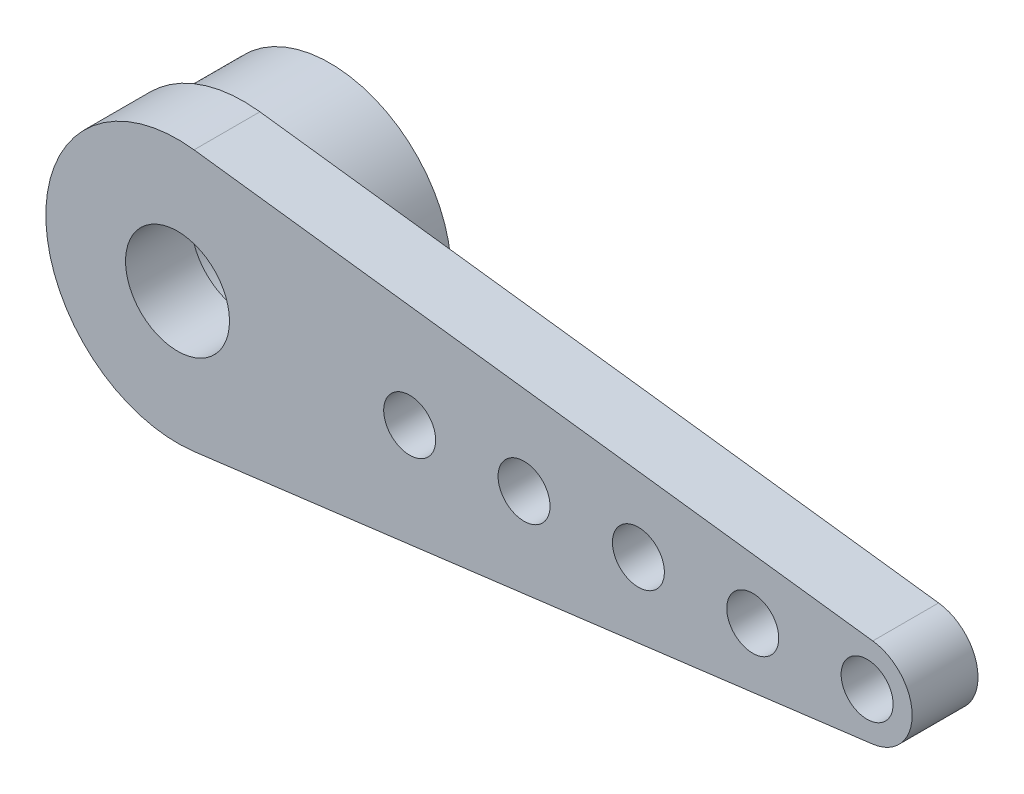
ISO-10303-21;
HEADER;
FILE_DESCRIPTION(('STEP AP214'),'2;1');
FILE_NAME('part.step','',(''),(''),'','','');
FILE_SCHEMA(('AUTOMOTIVE_DESIGN { 1 0 10303 214 1 1 1 1 }'));
ENDSEC;
DATA;
#1=APPLICATION_CONTEXT('core data for automotive mechanical design processes');
#2=APPLICATION_PROTOCOL_DEFINITION('international standard','automotive_design',2000,#1);
#3=PRODUCT_CONTEXT('',#1,'mechanical');
#4=PRODUCT('Part','Part','',(#3));
#5=PRODUCT_RELATED_PRODUCT_CATEGORY('part','',(#4));
#6=PRODUCT_DEFINITION_FORMATION('','',#4);
#7=PRODUCT_DEFINITION_CONTEXT('part definition',#1,'design');
#8=PRODUCT_DEFINITION('design','',#6,#7);
#9=PRODUCT_DEFINITION_SHAPE('','',#8);
#10=(LENGTH_UNIT() NAMED_UNIT(*) SI_UNIT(.MILLI.,.METRE.));
#11=(NAMED_UNIT(*) PLANE_ANGLE_UNIT() SI_UNIT($,.RADIAN.));
#12=(NAMED_UNIT(*) SI_UNIT($,.STERADIAN.) SOLID_ANGLE_UNIT());
#13=UNCERTAINTY_MEASURE_WITH_UNIT(LENGTH_MEASURE(1.E-05),#10,'distance_accuracy_value','');
#14=(GEOMETRIC_REPRESENTATION_CONTEXT(3) GLOBAL_UNCERTAINTY_ASSIGNED_CONTEXT((#13)) GLOBAL_UNIT_ASSIGNED_CONTEXT((#10,
#11,#12)) REPRESENTATION_CONTEXT('',''));
#15=CARTESIAN_POINT('',(0.,0.,0.));
#16=DIRECTION('',(0.,0.,1.));
#17=DIRECTION('',(1.,0.,0.));
#18=AXIS2_PLACEMENT_3D('',#15,#16,#17);
#19=CARTESIAN_POINT('',(0.,0.,0.));
#20=DIRECTION('',(0.,0.,1.));
#21=DIRECTION('',(1.,0.,0.));
#22=AXIS2_PLACEMENT_3D('',#19,#20,#21);
#23=PLANE('',#22);
#24=CARTESIAN_POINT('',(0.,0.,0.));
#25=DIRECTION('',(0.,0.,1.));
#26=DIRECTION('',(1.,0.,0.));
#27=AXIS2_PLACEMENT_3D('',#24,#25,#26);
#28=CIRCLE('',#27,1.5);
#29=CARTESIAN_POINT('',(1.5,0.,0.));
#30=VERTEX_POINT('',#29);
#31=EDGE_CURVE('E120',#30,#30,#28,.T.);
#32=ORIENTED_EDGE('',*,*,#31,.T.);
#33=EDGE_LOOP('',(#32));
#34=FACE_BOUND('',#33,.T.);
#35=CARTESIAN_POINT('',(0.,0.,0.));
#36=DIRECTION('',(0.,0.,1.));
#37=DIRECTION('',(1.,0.,0.));
#38=AXIS2_PLACEMENT_3D('',#35,#36,#37);
#39=CIRCLE('',#38,2.30779537514356);
#40=CARTESIAN_POINT('',(2.30779537514356,0.,0.));
#41=VERTEX_POINT('',#40);
#42=EDGE_CURVE('E11',#41,#41,#39,.T.);
#43=ORIENTED_EDGE('',*,*,#42,.F.);
#44=EDGE_LOOP('',(#43));
#45=FACE_BOUND('',#44,.T.);
#46=ADVANCED_FACE('F37',(#34,#45),#23,.F.);
#47=CARTESIAN_POINT('',(0.,0.,1.9));
#48=DIRECTION('',(0.,0.,1.));
#49=DIRECTION('',(1.,0.,0.));
#50=AXIS2_PLACEMENT_3D('',#47,#48,#49);
#51=PLANE('',#50);
#52=CARTESIAN_POINT('',(13.3,0.,1.9));
#53=DIRECTION('',(0.,0.,1.));
#54=DIRECTION('',(1.,0.,0.));
#55=AXIS2_PLACEMENT_3D('',#52,#53,#54);
#56=CIRCLE('',#55,0.75);
#57=CARTESIAN_POINT('',(14.05,0.,1.9));
#58=VERTEX_POINT('',#57);
#59=EDGE_CURVE('E141',#58,#58,#56,.T.);
#60=ORIENTED_EDGE('',*,*,#59,.F.);
#61=EDGE_LOOP('',(#60));
#62=FACE_BOUND('',#61,.T.);
#63=CARTESIAN_POINT('',(6.7,0.,1.9));
#64=DIRECTION('',(0.,0.,1.));
#65=DIRECTION('',(1.,0.,0.));
#66=AXIS2_PLACEMENT_3D('',#63,#64,#65);
#67=CIRCLE('',#66,0.749999999999999);
#68=CARTESIAN_POINT('',(7.45,0.,1.9));
#69=VERTEX_POINT('',#68);
#70=EDGE_CURVE('E129',#69,#69,#67,.T.);
#71=ORIENTED_EDGE('',*,*,#70,.F.);
#72=EDGE_LOOP('',(#71));
#73=FACE_BOUND('',#72,.T.);
#74=CARTESIAN_POINT('',(0.,0.,1.9));
#75=DIRECTION('',(0.,0.,1.));
#76=DIRECTION('',(1.,0.,0.));
#77=AXIS2_PLACEMENT_3D('',#74,#75,#76);
#78=CIRCLE('',#77,1.5);
#79=CARTESIAN_POINT('',(1.5,0.,1.9));
#80=VERTEX_POINT('',#79);
#81=EDGE_CURVE('E108',#80,#80,#78,.T.);
#82=ORIENTED_EDGE('',*,*,#81,.F.);
#83=EDGE_LOOP('',(#82));
#84=FACE_BOUND('',#83,.T.);
#85=CARTESIAN_POINT('',(0.,0.,1.9));
#86=DIRECTION('',(0.,0.,1.));
#87=DIRECTION('',(1.,0.,0.));
#88=AXIS2_PLACEMENT_3D('',#85,#86,#87);
#89=CIRCLE('',#88,3.8);
#90=CARTESIAN_POINT('',(0.477386934673366,3.76989412511852,1.9));
#91=VERTEX_POINT('',#90);
#92=CARTESIAN_POINT('',(0.477386934673366,-3.76989412511852,1.9));
#93=VERTEX_POINT('',#92);
#94=EDGE_CURVE('E92',#91,#93,#89,.T.);
#95=ORIENTED_EDGE('',*,*,#94,.T.);
#96=DIRECTION('',(0.99207740134698,0.125628140703517,0.));
#97=VECTOR('',#96,1.);
#98=CARTESIAN_POINT('',(0.477386934673366,-3.76989412511852,1.9));
#99=LINE('',#98,#97);
#100=CARTESIAN_POINT('',(20.0633165829146,-1.28970062175108,1.9));
#101=VERTEX_POINT('',#100);
#102=EDGE_CURVE('E86',#93,#101,#99,.T.);
#103=ORIENTED_EDGE('',*,*,#102,.T.);
#104=CARTESIAN_POINT('',(19.9,0.,1.9));
#105=DIRECTION('',(0.,0.,1.));
#106=DIRECTION('',(1.,0.,0.));
#107=AXIS2_PLACEMENT_3D('',#104,#105,#106);
#108=CIRCLE('',#107,1.3);
#109=CARTESIAN_POINT('',(20.0633165829146,1.28970062175108,1.9));
#110=VERTEX_POINT('',#109);
#111=EDGE_CURVE('E90',#101,#110,#108,.T.);
#112=ORIENTED_EDGE('',*,*,#111,.T.);
#113=DIRECTION('',(-0.99207740134698,0.125628140703517,0.));
#114=VECTOR('',#113,1.);
#115=CARTESIAN_POINT('',(0.477386934673366,3.76989412511852,1.9));
#116=LINE('',#115,#114);
#117=EDGE_CURVE('E55',#110,#91,#116,.T.);
#118=ORIENTED_EDGE('',*,*,#117,.T.);
#119=EDGE_LOOP('',(#95,#103,#112,#118));
#120=FACE_BOUND('',#119,.T.);
#121=CARTESIAN_POINT('',(19.9,0.,1.9));
#122=DIRECTION('',(0.,0.,1.));
#123=DIRECTION('',(1.,0.,0.));
#124=AXIS2_PLACEMENT_3D('',#121,#122,#123);
#125=CIRCLE('',#124,0.750000000000002);
#126=CARTESIAN_POINT('',(20.65,0.,1.9));
#127=VERTEX_POINT('',#126);
#128=EDGE_CURVE('E123',#127,#127,#125,.T.);
#129=ORIENTED_EDGE('',*,*,#128,.F.);
#130=EDGE_LOOP('',(#129));
#131=FACE_BOUND('',#130,.T.);
#132=CARTESIAN_POINT('',(10.,0.,1.9));
#133=DIRECTION('',(0.,0.,1.));
#134=DIRECTION('',(1.,0.,0.));
#135=AXIS2_PLACEMENT_3D('',#132,#133,#134);
#136=CIRCLE('',#135,0.75);
#137=CARTESIAN_POINT('',(10.75,0.,1.9));
#138=VERTEX_POINT('',#137);
#139=EDGE_CURVE('E135',#138,#138,#136,.T.);
#140=ORIENTED_EDGE('',*,*,#139,.F.);
#141=EDGE_LOOP('',(#140));
#142=FACE_BOUND('',#141,.T.);
#143=CARTESIAN_POINT('',(16.6,0.,1.9));
#144=DIRECTION('',(0.,0.,1.));
#145=DIRECTION('',(1.,0.,0.));
#146=AXIS2_PLACEMENT_3D('',#143,#144,#145);
#147=CIRCLE('',#146,0.750000000000002);
#148=CARTESIAN_POINT('',(17.35,0.,1.9));
#149=VERTEX_POINT('',#148);
#150=EDGE_CURVE('E147',#149,#149,#147,.T.);
#151=ORIENTED_EDGE('',*,*,#150,.F.);
#152=EDGE_LOOP('',(#151));
#153=FACE_BOUND('',#152,.T.);
#154=ADVANCED_FACE('F87',(#62,#73,#84,#120,#131,#142,#153),#51,.T.);
#155=CARTESIAN_POINT('',(0.,0.,0.));
#156=DIRECTION('',(0.,0.,1.));
#157=DIRECTION('',(1.,0.,0.));
#158=AXIS2_PLACEMENT_3D('',#155,#156,#157);
#159=CIRCLE('',#158,3.5);
#160=CARTESIAN_POINT('',(3.5,0.,0.));
#161=VERTEX_POINT('',#160);
#162=EDGE_CURVE('E156',#161,#161,#159,.T.);
#163=ORIENTED_EDGE('',*,*,#162,.T.);
#164=EDGE_LOOP('',(#163));
#165=FACE_BOUND('',#164,.T.);
#166=CARTESIAN_POINT('',(0.,0.,0.));
#167=DIRECTION('',(0.,0.,1.));
#168=DIRECTION('',(1.,0.,0.));
#169=AXIS2_PLACEMENT_3D('',#166,#167,#168);
#170=CIRCLE('',#169,3.8);
#171=CARTESIAN_POINT('',(0.477386934673366,3.76989412511852,0.));
#172=VERTEX_POINT('',#171);
#173=CARTESIAN_POINT('',(0.477386934673366,-3.76989412511852,0.));
#174=VERTEX_POINT('',#173);
#175=EDGE_CURVE('E105',#172,#174,#170,.T.);
#176=ORIENTED_EDGE('',*,*,#175,.F.);
#177=DIRECTION('',(-0.99207740134698,0.125628140703517,0.));
#178=VECTOR('',#177,1.);
#179=CARTESIAN_POINT('',(0.477386934673366,3.76989412511852,0.));
#180=LINE('',#179,#178);
#181=CARTESIAN_POINT('',(20.0633165829146,1.28970062175108,0.));
#182=VERTEX_POINT('',#181);
#183=EDGE_CURVE('E78',#182,#172,#180,.T.);
#184=ORIENTED_EDGE('',*,*,#183,.F.);
#185=CARTESIAN_POINT('',(19.9,0.,0.));
#186=DIRECTION('',(0.,0.,1.));
#187=DIRECTION('',(1.,0.,0.));
#188=AXIS2_PLACEMENT_3D('',#185,#186,#187);
#189=CIRCLE('',#188,1.3);
#190=CARTESIAN_POINT('',(20.0633165829146,-1.28970062175108,0.));
#191=VERTEX_POINT('',#190);
#192=EDGE_CURVE('E72',#191,#182,#189,.T.);
#193=ORIENTED_EDGE('',*,*,#192,.F.);
#194=DIRECTION('',(0.99207740134698,0.125628140703517,0.));
#195=VECTOR('',#194,1.);
#196=CARTESIAN_POINT('',(0.477386934673366,-3.76989412511852,0.));
#197=LINE('',#196,#195);
#198=EDGE_CURVE('E97',#174,#191,#197,.T.);
#199=ORIENTED_EDGE('',*,*,#198,.F.);
#200=EDGE_LOOP('',(#176,#184,#193,#199));
#201=FACE_BOUND('',#200,.T.);
#202=CARTESIAN_POINT('',(19.9,0.,0.));
#203=DIRECTION('',(0.,0.,1.));
#204=DIRECTION('',(1.,0.,0.));
#205=AXIS2_PLACEMENT_3D('',#202,#203,#204);
#206=CIRCLE('',#205,0.750000000000002);
#207=CARTESIAN_POINT('',(20.65,0.,0.));
#208=VERTEX_POINT('',#207);
#209=EDGE_CURVE('E126',#208,#208,#206,.T.);
#210=ORIENTED_EDGE('',*,*,#209,.T.);
#211=EDGE_LOOP('',(#210));
#212=FACE_BOUND('',#211,.T.);
#213=CARTESIAN_POINT('',(6.7,0.,0.));
#214=DIRECTION('',(0.,0.,1.));
#215=DIRECTION('',(1.,0.,0.));
#216=AXIS2_PLACEMENT_3D('',#213,#214,#215);
#217=CIRCLE('',#216,0.749999999999999);
#218=CARTESIAN_POINT('',(7.45,0.,0.));
#219=VERTEX_POINT('',#218);
#220=EDGE_CURVE('E132',#219,#219,#217,.T.);
#221=ORIENTED_EDGE('',*,*,#220,.T.);
#222=EDGE_LOOP('',(#221));
#223=FACE_BOUND('',#222,.T.);
#224=CARTESIAN_POINT('',(10.,0.,0.));
#225=DIRECTION('',(0.,0.,1.));
#226=DIRECTION('',(1.,0.,0.));
#227=AXIS2_PLACEMENT_3D('',#224,#225,#226);
#228=CIRCLE('',#227,0.75);
#229=CARTESIAN_POINT('',(10.75,0.,0.));
#230=VERTEX_POINT('',#229);
#231=EDGE_CURVE('E138',#230,#230,#228,.T.);
#232=ORIENTED_EDGE('',*,*,#231,.T.);
#233=EDGE_LOOP('',(#232));
#234=FACE_BOUND('',#233,.T.);
#235=CARTESIAN_POINT('',(13.3,0.,0.));
#236=DIRECTION('',(0.,0.,1.));
#237=DIRECTION('',(1.,0.,0.));
#238=AXIS2_PLACEMENT_3D('',#235,#236,#237);
#239=CIRCLE('',#238,0.75);
#240=CARTESIAN_POINT('',(14.05,0.,0.));
#241=VERTEX_POINT('',#240);
#242=EDGE_CURVE('E144',#241,#241,#239,.T.);
#243=ORIENTED_EDGE('',*,*,#242,.T.);
#244=EDGE_LOOP('',(#243));
#245=FACE_BOUND('',#244,.T.);
#246=CARTESIAN_POINT('',(16.6,0.,0.));
#247=DIRECTION('',(0.,0.,1.));
#248=DIRECTION('',(1.,0.,0.));
#249=AXIS2_PLACEMENT_3D('',#246,#247,#248);
#250=CIRCLE('',#249,0.750000000000002);
#251=CARTESIAN_POINT('',(17.35,0.,0.));
#252=VERTEX_POINT('',#251);
#253=EDGE_CURVE('E150',#252,#252,#250,.T.);
#254=ORIENTED_EDGE('',*,*,#253,.T.);
#255=EDGE_LOOP('',(#254));
#256=FACE_BOUND('',#255,.T.);
#257=ADVANCED_FACE('F116',(#165,#201,#212,#223,#234,#245,#256),#23,.F.);
#258=CARTESIAN_POINT('',(0.,0.,1.9));
#259=DIRECTION('',(0.,0.,-1.));
#260=DIRECTION('',(-1.,0.,0.));
#261=AXIS2_PLACEMENT_3D('',#258,#259,#260);
#262=CYLINDRICAL_SURFACE('',#261,3.8);
#263=ORIENTED_EDGE('',*,*,#175,.T.);
#264=DIRECTION('',(0.,0.,-1.));
#265=VECTOR('',#264,1.);
#266=CARTESIAN_POINT('',(0.477386934673366,-3.76989412511852,1.9));
#267=LINE('',#266,#265);
#268=EDGE_CURVE('E41',#93,#174,#267,.T.);
#269=ORIENTED_EDGE('',*,*,#268,.F.);
#270=ORIENTED_EDGE('',*,*,#94,.F.);
#271=DIRECTION('',(0.,0.,-1.));
#272=VECTOR('',#271,1.);
#273=CARTESIAN_POINT('',(0.477386934673366,3.76989412511852,1.9));
#274=LINE('',#273,#272);
#275=EDGE_CURVE('E101',#91,#172,#274,.T.);
#276=ORIENTED_EDGE('',*,*,#275,.T.);
#277=EDGE_LOOP('',(#263,#269,#270,#276));
#278=FACE_BOUND('',#277,.T.);
#279=ADVANCED_FACE('F39',(#278),#262,.T.);
#280=CARTESIAN_POINT('',(0.477386934673366,-3.76989412511852,1.9));
#281=DIRECTION('',(-0.125628140703517,0.99207740134698,0.));
#282=DIRECTION('',(-0.99207740134698,-0.125628140703517,0.));
#283=AXIS2_PLACEMENT_3D('',#280,#281,#282);
#284=PLANE('',#283);
#285=ORIENTED_EDGE('',*,*,#198,.T.);
#286=DIRECTION('',(0.,0.,-1.));
#287=VECTOR('',#286,1.);
#288=CARTESIAN_POINT('',(20.0633165829146,-1.28970062175108,1.9));
#289=LINE('',#288,#287);
#290=EDGE_CURVE('E95',#101,#191,#289,.T.);
#291=ORIENTED_EDGE('',*,*,#290,.F.);
#292=ORIENTED_EDGE('',*,*,#102,.F.);
#293=ORIENTED_EDGE('',*,*,#268,.T.);
#294=EDGE_LOOP('',(#285,#291,#292,#293));
#295=FACE_BOUND('',#294,.T.);
#296=ADVANCED_FACE('F96',(#295),#284,.F.);
#297=CARTESIAN_POINT('',(19.9,0.,1.9));
#298=DIRECTION('',(0.,0.,-1.));
#299=DIRECTION('',(-1.,0.,0.));
#300=AXIS2_PLACEMENT_3D('',#297,#298,#299);
#301=CYLINDRICAL_SURFACE('',#300,1.3);
#302=ORIENTED_EDGE('',*,*,#192,.T.);
#303=DIRECTION('',(0.,0.,-1.));
#304=VECTOR('',#303,1.);
#305=CARTESIAN_POINT('',(20.0633165829146,1.28970062175108,1.9));
#306=LINE('',#305,#304);
#307=EDGE_CURVE('E98',#110,#182,#306,.T.);
#308=ORIENTED_EDGE('',*,*,#307,.F.);
#309=ORIENTED_EDGE('',*,*,#111,.F.);
#310=ORIENTED_EDGE('',*,*,#290,.T.);
#311=EDGE_LOOP('',(#302,#308,#309,#310));
#312=FACE_BOUND('',#311,.T.);
#313=ADVANCED_FACE('F99',(#312),#301,.T.);
#314=CARTESIAN_POINT('',(0.477386934673366,3.76989412511852,1.9));
#315=DIRECTION('',(-0.125628140703517,-0.99207740134698,0.));
#316=DIRECTION('',(0.99207740134698,-0.125628140703517,0.));
#317=AXIS2_PLACEMENT_3D('',#314,#315,#316);
#318=PLANE('',#317);
#319=ORIENTED_EDGE('',*,*,#183,.T.);
#320=ORIENTED_EDGE('',*,*,#275,.F.);
#321=ORIENTED_EDGE('',*,*,#117,.F.);
#322=ORIENTED_EDGE('',*,*,#307,.T.);
#323=EDGE_LOOP('',(#319,#320,#321,#322));
#324=FACE_BOUND('',#323,.T.);
#325=ADVANCED_FACE('F113',(#324),#318,.F.);
#326=CARTESIAN_POINT('',(0.,0.,1.9));
#327=DIRECTION('',(0.,0.,-1.));
#328=DIRECTION('',(-1.,0.,0.));
#329=AXIS2_PLACEMENT_3D('',#326,#327,#328);
#330=CYLINDRICAL_SURFACE('',#329,1.5);
#331=ORIENTED_EDGE('',*,*,#81,.T.);
#332=EDGE_LOOP('',(#331));
#333=FACE_BOUND('',#332,.T.);
#334=ORIENTED_EDGE('',*,*,#31,.F.);
#335=EDGE_LOOP('',(#334));
#336=FACE_BOUND('',#335,.T.);
#337=ADVANCED_FACE('F218',(#333,#336),#330,.F.);
#338=CARTESIAN_POINT('',(19.9,0.,1.9));
#339=DIRECTION('',(0.,0.,-1.));
#340=DIRECTION('',(-1.,0.,0.));
#341=AXIS2_PLACEMENT_3D('',#338,#339,#340);
#342=CYLINDRICAL_SURFACE('',#341,0.750000000000002);
#343=ORIENTED_EDGE('',*,*,#128,.T.);
#344=EDGE_LOOP('',(#343));
#345=FACE_BOUND('',#344,.T.);
#346=ORIENTED_EDGE('',*,*,#209,.F.);
#347=EDGE_LOOP('',(#346));
#348=FACE_BOUND('',#347,.T.);
#349=ADVANCED_FACE('F214',(#345,#348),#342,.F.);
#350=CARTESIAN_POINT('',(6.7,0.,1.9));
#351=DIRECTION('',(0.,0.,-1.));
#352=DIRECTION('',(-1.,0.,0.));
#353=AXIS2_PLACEMENT_3D('',#350,#351,#352);
#354=CYLINDRICAL_SURFACE('',#353,0.749999999999999);
#355=ORIENTED_EDGE('',*,*,#70,.T.);
#356=EDGE_LOOP('',(#355));
#357=FACE_BOUND('',#356,.T.);
#358=ORIENTED_EDGE('',*,*,#220,.F.);
#359=EDGE_LOOP('',(#358));
#360=FACE_BOUND('',#359,.T.);
#361=ADVANCED_FACE('F210',(#357,#360),#354,.F.);
#362=CARTESIAN_POINT('',(10.,0.,1.9));
#363=DIRECTION('',(0.,0.,-1.));
#364=DIRECTION('',(-1.,0.,0.));
#365=AXIS2_PLACEMENT_3D('',#362,#363,#364);
#366=CYLINDRICAL_SURFACE('',#365,0.75);
#367=ORIENTED_EDGE('',*,*,#139,.T.);
#368=EDGE_LOOP('',(#367));
#369=FACE_BOUND('',#368,.T.);
#370=ORIENTED_EDGE('',*,*,#231,.F.);
#371=EDGE_LOOP('',(#370));
#372=FACE_BOUND('',#371,.T.);
#373=ADVANCED_FACE('F206',(#369,#372),#366,.F.);
#374=CARTESIAN_POINT('',(13.3,0.,1.9));
#375=DIRECTION('',(0.,0.,-1.));
#376=DIRECTION('',(-1.,0.,0.));
#377=AXIS2_PLACEMENT_3D('',#374,#375,#376);
#378=CYLINDRICAL_SURFACE('',#377,0.75);
#379=ORIENTED_EDGE('',*,*,#59,.T.);
#380=EDGE_LOOP('',(#379));
#381=FACE_BOUND('',#380,.T.);
#382=ORIENTED_EDGE('',*,*,#242,.F.);
#383=EDGE_LOOP('',(#382));
#384=FACE_BOUND('',#383,.T.);
#385=ADVANCED_FACE('F200',(#381,#384),#378,.F.);
#386=CARTESIAN_POINT('',(16.6,0.,1.9));
#387=DIRECTION('',(0.,0.,-1.));
#388=DIRECTION('',(-1.,0.,0.));
#389=AXIS2_PLACEMENT_3D('',#386,#387,#388);
#390=CYLINDRICAL_SURFACE('',#389,0.750000000000002);
#391=ORIENTED_EDGE('',*,*,#150,.T.);
#392=EDGE_LOOP('',(#391));
#393=FACE_BOUND('',#392,.T.);
#394=ORIENTED_EDGE('',*,*,#253,.F.);
#395=EDGE_LOOP('',(#394));
#396=FACE_BOUND('',#395,.T.);
#397=ADVANCED_FACE('F192',(#393,#396),#390,.F.);
#398=CARTESIAN_POINT('',(0.,0.,-2.5));
#399=DIRECTION('',(0.,0.,1.));
#400=DIRECTION('',(1.,0.,0.));
#401=AXIS2_PLACEMENT_3D('',#398,#399,#400);
#402=CYLINDRICAL_SURFACE('',#401,3.5);
#403=CARTESIAN_POINT('',(0.,0.,-2.5));
#404=DIRECTION('',(0.,0.,1.));
#405=DIRECTION('',(1.,0.,0.));
#406=AXIS2_PLACEMENT_3D('',#403,#404,#405);
#407=CIRCLE('',#406,3.5);
#408=CARTESIAN_POINT('',(3.5,0.,-2.5));
#409=VERTEX_POINT('',#408);
#410=EDGE_CURVE('E153',#409,#409,#407,.T.);
#411=ORIENTED_EDGE('',*,*,#410,.T.);
#412=EDGE_LOOP('',(#411));
#413=FACE_BOUND('',#412,.T.);
#414=ORIENTED_EDGE('',*,*,#162,.F.);
#415=EDGE_LOOP('',(#414));
#416=FACE_BOUND('',#415,.T.);
#417=ADVANCED_FACE('F190',(#413,#416),#402,.T.);
#418=CARTESIAN_POINT('',(0.,0.,-2.5));
#419=DIRECTION('',(0.,0.,1.));
#420=DIRECTION('',(1.,0.,0.));
#421=AXIS2_PLACEMENT_3D('',#418,#419,#420);
#422=PLANE('',#421);
#423=CARTESIAN_POINT('',(0.,0.,-2.5));
#424=DIRECTION('',(0.,0.,1.));
#425=DIRECTION('',(1.,0.,0.));
#426=AXIS2_PLACEMENT_3D('',#423,#424,#425);
#427=CIRCLE('',#426,2.30779537514356);
#428=CARTESIAN_POINT('',(2.30779537514356,0.,-2.5));
#429=VERTEX_POINT('',#428);
#430=EDGE_CURVE('E159',#429,#429,#427,.T.);
#431=ORIENTED_EDGE('',*,*,#430,.T.);
#432=EDGE_LOOP('',(#431));
#433=FACE_BOUND('',#432,.T.);
#434=ORIENTED_EDGE('',*,*,#410,.F.);
#435=EDGE_LOOP('',(#434));
#436=FACE_BOUND('',#435,.T.);
#437=ADVANCED_FACE('F165',(#433,#436),#422,.F.);
#438=CARTESIAN_POINT('',(0.,0.,-2.5));
#439=DIRECTION('',(0.,0.,1.));
#440=DIRECTION('',(1.,0.,0.));
#441=AXIS2_PLACEMENT_3D('',#438,#439,#440);
#442=CYLINDRICAL_SURFACE('',#441,2.30779537514356);
#443=ORIENTED_EDGE('',*,*,#430,.F.);
#444=EDGE_LOOP('',(#443));
#445=FACE_BOUND('',#444,.T.);
#446=ORIENTED_EDGE('',*,*,#42,.T.);
#447=EDGE_LOOP('',(#446));
#448=FACE_BOUND('',#447,.T.);
#449=ADVANCED_FACE('F168',(#445,#448),#442,.F.);
#450=CLOSED_SHELL('',(#46,#154,#257,#279,#296,#313,#325,#337,#349,#361,#373,#385,#397,#417,#437,#449));
#451=MANIFOLD_SOLID_BREP('B2',#450);
#452=ADVANCED_BREP_SHAPE_REPRESENTATION('',(#18,#451),#14);
#453=SHAPE_DEFINITION_REPRESENTATION(#9,#452);
ENDSEC;
END-ISO-10303-21;
